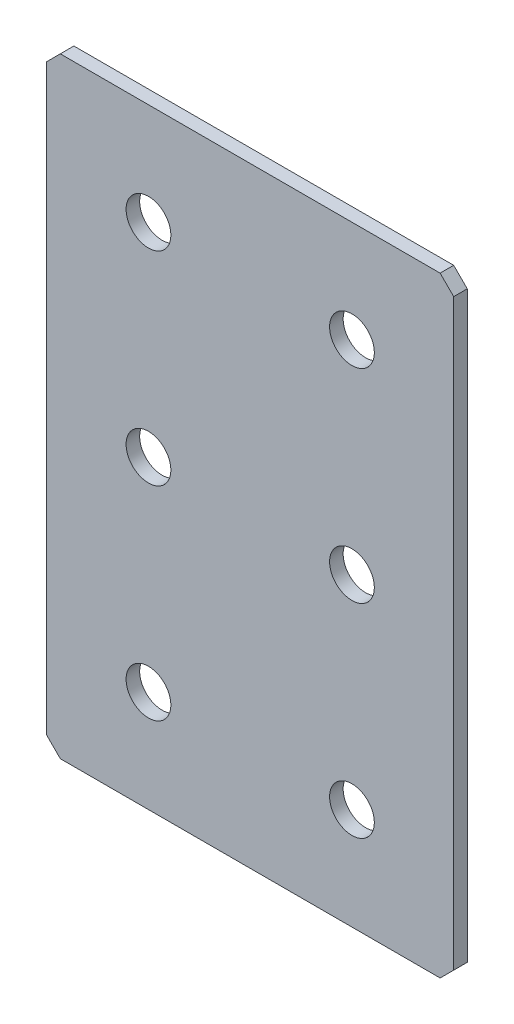
ISO-10303-21;
HEADER;
FILE_DESCRIPTION(('STEP AP214'),'2;1');
FILE_NAME('part.step','',(''),(''),'','','');
FILE_SCHEMA(('AUTOMOTIVE_DESIGN { 1 0 10303 214 1 1 1 1 }'));
ENDSEC;
DATA;
#1=APPLICATION_CONTEXT('core data for automotive mechanical design processes');
#2=APPLICATION_PROTOCOL_DEFINITION('international standard','automotive_design',2000,#1);
#3=PRODUCT_CONTEXT('',#1,'mechanical');
#4=PRODUCT('Part','Part','',(#3));
#5=PRODUCT_RELATED_PRODUCT_CATEGORY('part','',(#4));
#6=PRODUCT_DEFINITION_FORMATION('','',#4);
#7=PRODUCT_DEFINITION_CONTEXT('part definition',#1,'design');
#8=PRODUCT_DEFINITION('design','',#6,#7);
#9=PRODUCT_DEFINITION_SHAPE('','',#8);
#10=(LENGTH_UNIT() NAMED_UNIT(*) SI_UNIT(.MILLI.,.METRE.));
#11=(NAMED_UNIT(*) PLANE_ANGLE_UNIT() SI_UNIT($,.RADIAN.));
#12=(NAMED_UNIT(*) SI_UNIT($,.STERADIAN.) SOLID_ANGLE_UNIT());
#13=UNCERTAINTY_MEASURE_WITH_UNIT(LENGTH_MEASURE(1.E-05),#10,'distance_accuracy_value','');
#14=(GEOMETRIC_REPRESENTATION_CONTEXT(3) GLOBAL_UNCERTAINTY_ASSIGNED_CONTEXT((#13)) GLOBAL_UNIT_ASSIGNED_CONTEXT((#10,
#11,#12)) REPRESENTATION_CONTEXT('',''));
#15=CARTESIAN_POINT('',(0.,0.,0.));
#16=DIRECTION('',(0.,0.,1.));
#17=DIRECTION('',(1.,0.,0.));
#18=AXIS2_PLACEMENT_3D('',#15,#16,#17);
#19=CARTESIAN_POINT('',(30.,-45.,2.));
#20=DIRECTION('',(-1.,0.,0.));
#21=DIRECTION('',(0.,0.,1.));
#22=AXIS2_PLACEMENT_3D('',#19,#20,#21);
#23=PLANE('',#22);
#24=DIRECTION('',(0.,1.,0.));
#25=VECTOR('',#24,1.);
#26=CARTESIAN_POINT('',(30.,-45.,2.));
#27=LINE('',#26,#25);
#28=CARTESIAN_POINT('',(30.,-43.,2.));
#29=VERTEX_POINT('',#28);
#30=CARTESIAN_POINT('',(30.,43.,2.));
#31=VERTEX_POINT('',#30);
#32=EDGE_CURVE('E136',#29,#31,#27,.T.);
#33=ORIENTED_EDGE('',*,*,#32,.F.);
#34=DIRECTION('',(0.,0.,-1.));
#35=VECTOR('',#34,1.);
#36=CARTESIAN_POINT('',(30.,-43.,2.));
#37=LINE('',#36,#35);
#38=CARTESIAN_POINT('',(30.,-43.,0.));
#39=VERTEX_POINT('',#38);
#40=EDGE_CURVE('E177',#29,#39,#37,.T.);
#41=ORIENTED_EDGE('',*,*,#40,.T.);
#42=DIRECTION('',(0.,1.,0.));
#43=VECTOR('',#42,1.);
#44=CARTESIAN_POINT('',(30.,-45.,0.));
#45=LINE('',#44,#43);
#46=CARTESIAN_POINT('',(30.,43.,0.));
#47=VERTEX_POINT('',#46);
#48=EDGE_CURVE('E188',#39,#47,#45,.T.);
#49=ORIENTED_EDGE('',*,*,#48,.T.);
#50=DIRECTION('',(0.,0.,1.));
#51=VECTOR('',#50,1.);
#52=CARTESIAN_POINT('',(30.,43.,2.));
#53=LINE('',#52,#51);
#54=EDGE_CURVE('E174',#47,#31,#53,.T.);
#55=ORIENTED_EDGE('',*,*,#54,.T.);
#56=EDGE_LOOP('',(#33,#41,#49,#55));
#57=FACE_BOUND('',#56,.T.);
#58=ADVANCED_FACE('F41',(#57),#23,.F.);
#59=CARTESIAN_POINT('',(-30.,45.,2.));
#60=DIRECTION('',(0.,-1.,0.));
#61=DIRECTION('',(0.,0.,-1.));
#62=AXIS2_PLACEMENT_3D('',#59,#60,#61);
#63=PLANE('',#62);
#64=DIRECTION('',(-1.,0.,0.));
#65=VECTOR('',#64,1.);
#66=CARTESIAN_POINT('',(-30.,45.,0.));
#67=LINE('',#66,#65);
#68=CARTESIAN_POINT('',(28.,45.,0.));
#69=VERTEX_POINT('',#68);
#70=CARTESIAN_POINT('',(-28.,45.,0.));
#71=VERTEX_POINT('',#70);
#72=EDGE_CURVE('E145',#69,#71,#67,.T.);
#73=ORIENTED_EDGE('',*,*,#72,.T.);
#74=DIRECTION('',(0.,0.,1.));
#75=VECTOR('',#74,1.);
#76=CARTESIAN_POINT('',(-28.,45.,2.));
#77=LINE('',#76,#75);
#78=CARTESIAN_POINT('',(-28.,45.,2.));
#79=VERTEX_POINT('',#78);
#80=EDGE_CURVE('E11',#71,#79,#77,.T.);
#81=ORIENTED_EDGE('',*,*,#80,.T.);
#82=DIRECTION('',(-1.,0.,0.));
#83=VECTOR('',#82,1.);
#84=CARTESIAN_POINT('',(-30.,45.,2.));
#85=LINE('',#84,#83);
#86=CARTESIAN_POINT('',(28.,45.,2.));
#87=VERTEX_POINT('',#86);
#88=EDGE_CURVE('E142',#87,#79,#85,.T.);
#89=ORIENTED_EDGE('',*,*,#88,.F.);
#90=DIRECTION('',(0.,0.,-1.));
#91=VECTOR('',#90,1.);
#92=CARTESIAN_POINT('',(28.,45.,2.));
#93=LINE('',#92,#91);
#94=EDGE_CURVE('E50',#87,#69,#93,.T.);
#95=ORIENTED_EDGE('',*,*,#94,.T.);
#96=EDGE_LOOP('',(#73,#81,#89,#95));
#97=FACE_BOUND('',#96,.T.);
#98=ADVANCED_FACE('F184',(#97),#63,.F.);
#99=CARTESIAN_POINT('',(-30.,-45.,2.));
#100=DIRECTION('',(1.,0.,0.));
#101=DIRECTION('',(0.,0.,-1.));
#102=AXIS2_PLACEMENT_3D('',#99,#100,#101);
#103=PLANE('',#102);
#104=DIRECTION('',(0.,-1.,0.));
#105=VECTOR('',#104,1.);
#106=CARTESIAN_POINT('',(-30.,-45.,0.));
#107=LINE('',#106,#105);
#108=CARTESIAN_POINT('',(-30.,43.,0.));
#109=VERTEX_POINT('',#108);
#110=CARTESIAN_POINT('',(-30.,-43.,0.));
#111=VERTEX_POINT('',#110);
#112=EDGE_CURVE('E137',#109,#111,#107,.T.);
#113=ORIENTED_EDGE('',*,*,#112,.T.);
#114=DIRECTION('',(0.,0.,1.));
#115=VECTOR('',#114,1.);
#116=CARTESIAN_POINT('',(-30.,-43.,2.));
#117=LINE('',#116,#115);
#118=CARTESIAN_POINT('',(-30.,-43.,2.));
#119=VERTEX_POINT('',#118);
#120=EDGE_CURVE('E112',#111,#119,#117,.T.);
#121=ORIENTED_EDGE('',*,*,#120,.T.);
#122=DIRECTION('',(0.,-1.,0.));
#123=VECTOR('',#122,1.);
#124=CARTESIAN_POINT('',(-30.,-45.,2.));
#125=LINE('',#124,#123);
#126=CARTESIAN_POINT('',(-30.,43.,2.));
#127=VERTEX_POINT('',#126);
#128=EDGE_CURVE('E195',#127,#119,#125,.T.);
#129=ORIENTED_EDGE('',*,*,#128,.F.);
#130=DIRECTION('',(0.,0.,-1.));
#131=VECTOR('',#130,1.);
#132=CARTESIAN_POINT('',(-30.,43.,2.));
#133=LINE('',#132,#131);
#134=EDGE_CURVE('E118',#127,#109,#133,.T.);
#135=ORIENTED_EDGE('',*,*,#134,.T.);
#136=EDGE_LOOP('',(#113,#121,#129,#135));
#137=FACE_BOUND('',#136,.T.);
#138=ADVANCED_FACE('F266',(#137),#103,.F.);
#139=CARTESIAN_POINT('',(-30.,-45.,2.));
#140=DIRECTION('',(0.,1.,0.));
#141=DIRECTION('',(0.,0.,1.));
#142=AXIS2_PLACEMENT_3D('',#139,#140,#141);
#143=PLANE('',#142);
#144=DIRECTION('',(1.,0.,0.));
#145=VECTOR('',#144,1.);
#146=CARTESIAN_POINT('',(-30.,-45.,2.));
#147=LINE('',#146,#145);
#148=CARTESIAN_POINT('',(-28.,-45.,2.));
#149=VERTEX_POINT('',#148);
#150=CARTESIAN_POINT('',(28.,-45.,2.));
#151=VERTEX_POINT('',#150);
#152=EDGE_CURVE('E128',#149,#151,#147,.T.);
#153=ORIENTED_EDGE('',*,*,#152,.F.);
#154=DIRECTION('',(0.,0.,-1.));
#155=VECTOR('',#154,1.);
#156=CARTESIAN_POINT('',(-28.,-45.,2.));
#157=LINE('',#156,#155);
#158=CARTESIAN_POINT('',(-28.,-45.,0.));
#159=VERTEX_POINT('',#158);
#160=EDGE_CURVE('E111',#149,#159,#157,.T.);
#161=ORIENTED_EDGE('',*,*,#160,.T.);
#162=DIRECTION('',(1.,0.,0.));
#163=VECTOR('',#162,1.);
#164=CARTESIAN_POINT('',(-30.,-45.,0.));
#165=LINE('',#164,#163);
#166=CARTESIAN_POINT('',(28.,-45.,0.));
#167=VERTEX_POINT('',#166);
#168=EDGE_CURVE('E125',#159,#167,#165,.T.);
#169=ORIENTED_EDGE('',*,*,#168,.T.);
#170=DIRECTION('',(0.,0.,1.));
#171=VECTOR('',#170,1.);
#172=CARTESIAN_POINT('',(28.,-45.,2.));
#173=LINE('',#172,#171);
#174=EDGE_CURVE('E131',#167,#151,#173,.T.);
#175=ORIENTED_EDGE('',*,*,#174,.T.);
#176=EDGE_LOOP('',(#153,#161,#169,#175));
#177=FACE_BOUND('',#176,.T.);
#178=ADVANCED_FACE('F124',(#177),#143,.F.);
#179=CARTESIAN_POINT('',(0.,0.,2.));
#180=DIRECTION('',(0.,0.,-1.));
#181=DIRECTION('',(-1.,0.,0.));
#182=AXIS2_PLACEMENT_3D('',#179,#180,#181);
#183=PLANE('',#182);
#184=CARTESIAN_POINT('',(-15.,30.,2.));
#185=DIRECTION('',(0.,0.,1.));
#186=DIRECTION('',(1.,0.,0.));
#187=AXIS2_PLACEMENT_3D('',#184,#185,#186);
#188=CIRCLE('',#187,3.3);
#189=CARTESIAN_POINT('',(-11.7,30.,2.));
#190=VERTEX_POINT('',#189);
#191=EDGE_CURVE('E242',#190,#190,#188,.T.);
#192=ORIENTED_EDGE('',*,*,#191,.F.);
#193=EDGE_LOOP('',(#192));
#194=FACE_BOUND('',#193,.T.);
#195=CARTESIAN_POINT('',(15.,30.,2.));
#196=DIRECTION('',(0.,0.,1.));
#197=DIRECTION('',(1.,0.,0.));
#198=AXIS2_PLACEMENT_3D('',#195,#196,#197);
#199=CIRCLE('',#198,3.3);
#200=CARTESIAN_POINT('',(18.3,30.,2.));
#201=VERTEX_POINT('',#200);
#202=EDGE_CURVE('E234',#201,#201,#199,.T.);
#203=ORIENTED_EDGE('',*,*,#202,.F.);
#204=EDGE_LOOP('',(#203));
#205=FACE_BOUND('',#204,.T.);
#206=CARTESIAN_POINT('',(15.,0.,2.));
#207=DIRECTION('',(0.,0.,1.));
#208=DIRECTION('',(1.,0.,0.));
#209=AXIS2_PLACEMENT_3D('',#206,#207,#208);
#210=CIRCLE('',#209,3.3);
#211=CARTESIAN_POINT('',(18.3,0.,2.));
#212=VERTEX_POINT('',#211);
#213=EDGE_CURVE('E226',#212,#212,#210,.T.);
#214=ORIENTED_EDGE('',*,*,#213,.F.);
#215=EDGE_LOOP('',(#214));
#216=FACE_BOUND('',#215,.T.);
#217=CARTESIAN_POINT('',(-15.,0.,2.));
#218=DIRECTION('',(0.,0.,1.));
#219=DIRECTION('',(1.,0.,0.));
#220=AXIS2_PLACEMENT_3D('',#217,#218,#219);
#221=CIRCLE('',#220,3.3);
#222=CARTESIAN_POINT('',(-11.7,0.,2.));
#223=VERTEX_POINT('',#222);
#224=EDGE_CURVE('E218',#223,#223,#221,.T.);
#225=ORIENTED_EDGE('',*,*,#224,.F.);
#226=EDGE_LOOP('',(#225));
#227=FACE_BOUND('',#226,.T.);
#228=CARTESIAN_POINT('',(-15.,-30.,2.));
#229=DIRECTION('',(0.,0.,1.));
#230=DIRECTION('',(1.,0.,0.));
#231=AXIS2_PLACEMENT_3D('',#228,#229,#230);
#232=CIRCLE('',#231,3.3);
#233=CARTESIAN_POINT('',(-11.7,-30.,2.));
#234=VERTEX_POINT('',#233);
#235=EDGE_CURVE('E210',#234,#234,#232,.T.);
#236=ORIENTED_EDGE('',*,*,#235,.F.);
#237=EDGE_LOOP('',(#236));
#238=FACE_BOUND('',#237,.T.);
#239=CARTESIAN_POINT('',(15.,-30.,2.));
#240=DIRECTION('',(0.,0.,1.));
#241=DIRECTION('',(1.,0.,0.));
#242=AXIS2_PLACEMENT_3D('',#239,#240,#241);
#243=CIRCLE('',#242,3.3);
#244=CARTESIAN_POINT('',(18.3,-30.,2.));
#245=VERTEX_POINT('',#244);
#246=EDGE_CURVE('E203',#245,#245,#243,.T.);
#247=ORIENTED_EDGE('',*,*,#246,.F.);
#248=EDGE_LOOP('',(#247));
#249=FACE_BOUND('',#248,.T.);
#250=ORIENTED_EDGE('',*,*,#128,.T.);
#251=DIRECTION('',(-0.707106781186545,0.70710678118655,0.));
#252=VECTOR('',#251,1.);
#253=CARTESIAN_POINT('',(-28.,-45.,2.));
#254=LINE('',#253,#252);
#255=EDGE_CURVE('E171',#119,#149,#254,.F.);
#256=ORIENTED_EDGE('',*,*,#255,.T.);
#257=ORIENTED_EDGE('',*,*,#152,.T.);
#258=DIRECTION('',(-0.70710678118655,-0.707106781186545,0.));
#259=VECTOR('',#258,1.);
#260=CARTESIAN_POINT('',(30.,-43.,2.));
#261=LINE('',#260,#259);
#262=EDGE_CURVE('E168',#151,#29,#261,.F.);
#263=ORIENTED_EDGE('',*,*,#262,.T.);
#264=ORIENTED_EDGE('',*,*,#32,.T.);
#265=DIRECTION('',(0.707106781186545,-0.70710678118655,0.));
#266=VECTOR('',#265,1.);
#267=CARTESIAN_POINT('',(28.,45.,2.));
#268=LINE('',#267,#266);
#269=EDGE_CURVE('E62',#31,#87,#268,.F.);
#270=ORIENTED_EDGE('',*,*,#269,.T.);
#271=ORIENTED_EDGE('',*,*,#88,.T.);
#272=DIRECTION('',(0.70710678118655,0.707106781186545,0.));
#273=VECTOR('',#272,1.);
#274=CARTESIAN_POINT('',(-30.,43.,2.));
#275=LINE('',#274,#273);
#276=EDGE_CURVE('E165',#79,#127,#275,.F.);
#277=ORIENTED_EDGE('',*,*,#276,.T.);
#278=EDGE_LOOP('',(#250,#256,#257,#263,#264,#270,#271,#277));
#279=FACE_BOUND('',#278,.T.);
#280=ADVANCED_FACE('F249',(#194,#205,#216,#227,#238,#249,#279),#183,.F.);
#281=CARTESIAN_POINT('',(0.,0.,0.));
#282=DIRECTION('',(0.,0.,-1.));
#283=DIRECTION('',(-1.,0.,0.));
#284=AXIS2_PLACEMENT_3D('',#281,#282,#283);
#285=PLANE('',#284);
#286=CARTESIAN_POINT('',(-15.,30.,0.));
#287=DIRECTION('',(0.,0.,1.));
#288=DIRECTION('',(1.,0.,0.));
#289=AXIS2_PLACEMENT_3D('',#286,#287,#288);
#290=CIRCLE('',#289,3.3);
#291=CARTESIAN_POINT('',(-11.7,30.,0.));
#292=VERTEX_POINT('',#291);
#293=EDGE_CURVE('E238',#292,#292,#290,.T.);
#294=ORIENTED_EDGE('',*,*,#293,.T.);
#295=EDGE_LOOP('',(#294));
#296=FACE_BOUND('',#295,.T.);
#297=CARTESIAN_POINT('',(15.,30.,0.));
#298=DIRECTION('',(0.,0.,1.));
#299=DIRECTION('',(1.,0.,0.));
#300=AXIS2_PLACEMENT_3D('',#297,#298,#299);
#301=CIRCLE('',#300,3.3);
#302=CARTESIAN_POINT('',(18.3,30.,0.));
#303=VERTEX_POINT('',#302);
#304=EDGE_CURVE('E230',#303,#303,#301,.T.);
#305=ORIENTED_EDGE('',*,*,#304,.T.);
#306=EDGE_LOOP('',(#305));
#307=FACE_BOUND('',#306,.T.);
#308=CARTESIAN_POINT('',(15.,0.,0.));
#309=DIRECTION('',(0.,0.,1.));
#310=DIRECTION('',(1.,0.,0.));
#311=AXIS2_PLACEMENT_3D('',#308,#309,#310);
#312=CIRCLE('',#311,3.3);
#313=CARTESIAN_POINT('',(18.3,0.,0.));
#314=VERTEX_POINT('',#313);
#315=EDGE_CURVE('E222',#314,#314,#312,.T.);
#316=ORIENTED_EDGE('',*,*,#315,.T.);
#317=EDGE_LOOP('',(#316));
#318=FACE_BOUND('',#317,.T.);
#319=CARTESIAN_POINT('',(-15.,0.,0.));
#320=DIRECTION('',(0.,0.,1.));
#321=DIRECTION('',(1.,0.,0.));
#322=AXIS2_PLACEMENT_3D('',#319,#320,#321);
#323=CIRCLE('',#322,3.3);
#324=CARTESIAN_POINT('',(-11.7,0.,0.));
#325=VERTEX_POINT('',#324);
#326=EDGE_CURVE('E214',#325,#325,#323,.T.);
#327=ORIENTED_EDGE('',*,*,#326,.T.);
#328=EDGE_LOOP('',(#327));
#329=FACE_BOUND('',#328,.T.);
#330=CARTESIAN_POINT('',(-15.,-30.,0.));
#331=DIRECTION('',(0.,0.,1.));
#332=DIRECTION('',(1.,0.,0.));
#333=AXIS2_PLACEMENT_3D('',#330,#331,#332);
#334=CIRCLE('',#333,3.3);
#335=CARTESIAN_POINT('',(-11.7,-30.,0.));
#336=VERTEX_POINT('',#335);
#337=EDGE_CURVE('E206',#336,#336,#334,.T.);
#338=ORIENTED_EDGE('',*,*,#337,.T.);
#339=EDGE_LOOP('',(#338));
#340=FACE_BOUND('',#339,.T.);
#341=CARTESIAN_POINT('',(15.,-30.,0.));
#342=DIRECTION('',(0.,0.,1.));
#343=DIRECTION('',(1.,0.,0.));
#344=AXIS2_PLACEMENT_3D('',#341,#342,#343);
#345=CIRCLE('',#344,3.3);
#346=CARTESIAN_POINT('',(18.3,-30.,0.));
#347=VERTEX_POINT('',#346);
#348=EDGE_CURVE('E190',#347,#347,#345,.T.);
#349=ORIENTED_EDGE('',*,*,#348,.T.);
#350=EDGE_LOOP('',(#349));
#351=FACE_BOUND('',#350,.T.);
#352=ORIENTED_EDGE('',*,*,#168,.F.);
#353=DIRECTION('',(0.707106781186545,-0.70710678118655,0.));
#354=VECTOR('',#353,1.);
#355=CARTESIAN_POINT('',(-36.5000000000001,-36.4999999999999,0.));
#356=LINE('',#355,#354);
#357=EDGE_CURVE('E107',#159,#111,#356,.F.);
#358=ORIENTED_EDGE('',*,*,#357,.T.);
#359=ORIENTED_EDGE('',*,*,#112,.F.);
#360=DIRECTION('',(-0.70710678118655,-0.707106781186545,0.));
#361=VECTOR('',#360,1.);
#362=CARTESIAN_POINT('',(-36.4999999999999,36.5000000000001,0.));
#363=LINE('',#362,#361);
#364=EDGE_CURVE('E153',#109,#71,#363,.F.);
#365=ORIENTED_EDGE('',*,*,#364,.T.);
#366=ORIENTED_EDGE('',*,*,#72,.F.);
#367=DIRECTION('',(-0.707106781186545,0.70710678118655,0.));
#368=VECTOR('',#367,1.);
#369=CARTESIAN_POINT('',(36.5000000000001,36.4999999999998,0.));
#370=LINE('',#369,#368);
#371=EDGE_CURVE('E130',#69,#47,#370,.F.);
#372=ORIENTED_EDGE('',*,*,#371,.T.);
#373=ORIENTED_EDGE('',*,*,#48,.F.);
#374=DIRECTION('',(0.70710678118655,0.707106781186545,0.));
#375=VECTOR('',#374,1.);
#376=CARTESIAN_POINT('',(36.4999999999999,-36.5000000000001,0.));
#377=LINE('',#376,#375);
#378=EDGE_CURVE('E119',#39,#167,#377,.F.);
#379=ORIENTED_EDGE('',*,*,#378,.T.);
#380=EDGE_LOOP('',(#352,#358,#359,#365,#366,#372,#373,#379));
#381=FACE_BOUND('',#380,.T.);
#382=ADVANCED_FACE('F133',(#296,#307,#318,#329,#340,#351,#381),#285,.T.);
#383=CARTESIAN_POINT('',(-28.,-45.,2.));
#384=DIRECTION('',(0.70710678118655,0.707106781186545,0.));
#385=DIRECTION('',(0.,0.,-1.));
#386=AXIS2_PLACEMENT_3D('',#383,#384,#385);
#387=PLANE('',#386);
#388=ORIENTED_EDGE('',*,*,#255,.F.);
#389=ORIENTED_EDGE('',*,*,#120,.F.);
#390=ORIENTED_EDGE('',*,*,#357,.F.);
#391=ORIENTED_EDGE('',*,*,#160,.F.);
#392=EDGE_LOOP('',(#388,#389,#390,#391));
#393=FACE_BOUND('',#392,.T.);
#394=ADVANCED_FACE('F110',(#393),#387,.F.);
#395=CARTESIAN_POINT('',(30.,-43.,2.));
#396=DIRECTION('',(-0.707106781186545,0.70710678118655,0.));
#397=DIRECTION('',(0.,0.,-1.));
#398=AXIS2_PLACEMENT_3D('',#395,#396,#397);
#399=PLANE('',#398);
#400=ORIENTED_EDGE('',*,*,#262,.F.);
#401=ORIENTED_EDGE('',*,*,#174,.F.);
#402=ORIENTED_EDGE('',*,*,#378,.F.);
#403=ORIENTED_EDGE('',*,*,#40,.F.);
#404=EDGE_LOOP('',(#400,#401,#402,#403));
#405=FACE_BOUND('',#404,.T.);
#406=ADVANCED_FACE('F270',(#405),#399,.F.);
#407=CARTESIAN_POINT('',(-30.,43.,2.));
#408=DIRECTION('',(0.707106781186545,-0.70710678118655,0.));
#409=DIRECTION('',(0.,0.,-1.));
#410=AXIS2_PLACEMENT_3D('',#407,#408,#409);
#411=PLANE('',#410);
#412=ORIENTED_EDGE('',*,*,#276,.F.);
#413=ORIENTED_EDGE('',*,*,#80,.F.);
#414=ORIENTED_EDGE('',*,*,#364,.F.);
#415=ORIENTED_EDGE('',*,*,#134,.F.);
#416=EDGE_LOOP('',(#412,#413,#414,#415));
#417=FACE_BOUND('',#416,.T.);
#418=ADVANCED_FACE('F268',(#417),#411,.F.);
#419=CARTESIAN_POINT('',(28.,45.,2.));
#420=DIRECTION('',(-0.70710678118655,-0.707106781186545,0.));
#421=DIRECTION('',(0.,0.,-1.));
#422=AXIS2_PLACEMENT_3D('',#419,#420,#421);
#423=PLANE('',#422);
#424=ORIENTED_EDGE('',*,*,#269,.F.);
#425=ORIENTED_EDGE('',*,*,#54,.F.);
#426=ORIENTED_EDGE('',*,*,#371,.F.);
#427=ORIENTED_EDGE('',*,*,#94,.F.);
#428=EDGE_LOOP('',(#424,#425,#426,#427));
#429=FACE_BOUND('',#428,.T.);
#430=ADVANCED_FACE('F43',(#429),#423,.F.);
#431=CARTESIAN_POINT('',(15.,-30.,2.));
#432=DIRECTION('',(0.,0.,1.));
#433=DIRECTION('',(1.,0.,0.));
#434=AXIS2_PLACEMENT_3D('',#431,#432,#433);
#435=CYLINDRICAL_SURFACE('',#434,3.3);
#436=ORIENTED_EDGE('',*,*,#348,.F.);
#437=EDGE_LOOP('',(#436));
#438=FACE_BOUND('',#437,.T.);
#439=ORIENTED_EDGE('',*,*,#246,.T.);
#440=EDGE_LOOP('',(#439));
#441=FACE_BOUND('',#440,.T.);
#442=ADVANCED_FACE('F275',(#438,#441),#435,.F.);
#443=CARTESIAN_POINT('',(-15.,-30.,2.));
#444=DIRECTION('',(0.,0.,1.));
#445=DIRECTION('',(1.,0.,0.));
#446=AXIS2_PLACEMENT_3D('',#443,#444,#445);
#447=CYLINDRICAL_SURFACE('',#446,3.3);
#448=ORIENTED_EDGE('',*,*,#337,.F.);
#449=EDGE_LOOP('',(#448));
#450=FACE_BOUND('',#449,.T.);
#451=ORIENTED_EDGE('',*,*,#235,.T.);
#452=EDGE_LOOP('',(#451));
#453=FACE_BOUND('',#452,.T.);
#454=ADVANCED_FACE('F337',(#450,#453),#447,.F.);
#455=CARTESIAN_POINT('',(-15.,0.,2.));
#456=DIRECTION('',(0.,0.,1.));
#457=DIRECTION('',(1.,0.,0.));
#458=AXIS2_PLACEMENT_3D('',#455,#456,#457);
#459=CYLINDRICAL_SURFACE('',#458,3.3);
#460=ORIENTED_EDGE('',*,*,#326,.F.);
#461=EDGE_LOOP('',(#460));
#462=FACE_BOUND('',#461,.T.);
#463=ORIENTED_EDGE('',*,*,#224,.T.);
#464=EDGE_LOOP('',(#463));
#465=FACE_BOUND('',#464,.T.);
#466=ADVANCED_FACE('F345',(#462,#465),#459,.F.);
#467=CARTESIAN_POINT('',(15.,0.,2.));
#468=DIRECTION('',(0.,0.,1.));
#469=DIRECTION('',(1.,0.,0.));
#470=AXIS2_PLACEMENT_3D('',#467,#468,#469);
#471=CYLINDRICAL_SURFACE('',#470,3.3);
#472=ORIENTED_EDGE('',*,*,#315,.F.);
#473=EDGE_LOOP('',(#472));
#474=FACE_BOUND('',#473,.T.);
#475=ORIENTED_EDGE('',*,*,#213,.T.);
#476=EDGE_LOOP('',(#475));
#477=FACE_BOUND('',#476,.T.);
#478=ADVANCED_FACE('F354',(#474,#477),#471,.F.);
#479=CARTESIAN_POINT('',(15.,30.,2.));
#480=DIRECTION('',(0.,0.,1.));
#481=DIRECTION('',(1.,0.,0.));
#482=AXIS2_PLACEMENT_3D('',#479,#480,#481);
#483=CYLINDRICAL_SURFACE('',#482,3.3);
#484=ORIENTED_EDGE('',*,*,#304,.F.);
#485=EDGE_LOOP('',(#484));
#486=FACE_BOUND('',#485,.T.);
#487=ORIENTED_EDGE('',*,*,#202,.T.);
#488=EDGE_LOOP('',(#487));
#489=FACE_BOUND('',#488,.T.);
#490=ADVANCED_FACE('F363',(#486,#489),#483,.F.);
#491=CARTESIAN_POINT('',(-15.,30.,2.));
#492=DIRECTION('',(0.,0.,1.));
#493=DIRECTION('',(1.,0.,0.));
#494=AXIS2_PLACEMENT_3D('',#491,#492,#493);
#495=CYLINDRICAL_SURFACE('',#494,3.3);
#496=ORIENTED_EDGE('',*,*,#293,.F.);
#497=EDGE_LOOP('',(#496));
#498=FACE_BOUND('',#497,.T.);
#499=ORIENTED_EDGE('',*,*,#191,.T.);
#500=EDGE_LOOP('',(#499));
#501=FACE_BOUND('',#500,.T.);
#502=ADVANCED_FACE('F247',(#498,#501),#495,.F.);
#503=CLOSED_SHELL('',(#58,#98,#138,#178,#280,#382,#394,#406,#418,#430,#442,#454,#466,#478,#490,#502));
#504=MANIFOLD_SOLID_BREP('B2',#503);
#505=ADVANCED_BREP_SHAPE_REPRESENTATION('',(#18,#504),#14);
#506=SHAPE_DEFINITION_REPRESENTATION(#9,#505);
ENDSEC;
END-ISO-10303-21;
